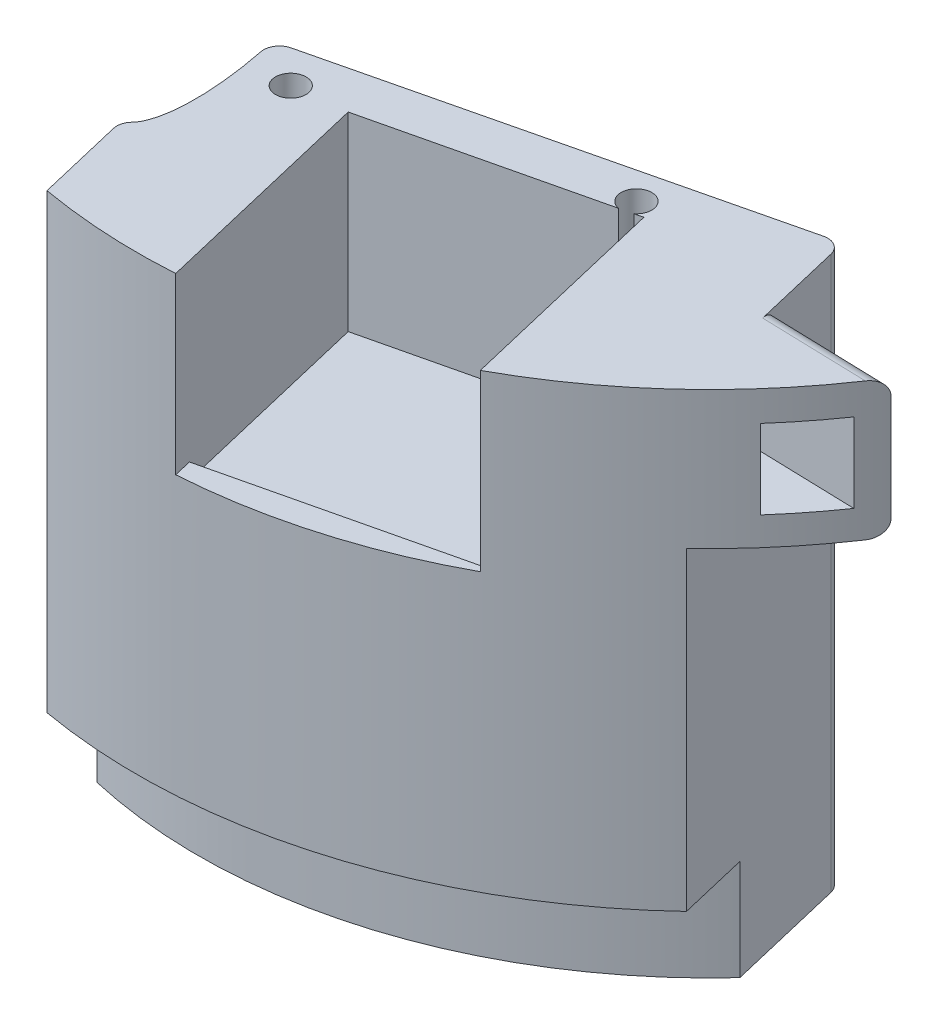
ISO-10303-21;
HEADER;
FILE_DESCRIPTION(('STEP AP214'),'2;1');
FILE_NAME('part.step','',(''),(''),'','','');
FILE_SCHEMA(('AUTOMOTIVE_DESIGN { 1 0 10303 214 1 1 1 1 }'));
ENDSEC;
DATA;
#1=APPLICATION_CONTEXT('core data for automotive mechanical design processes');
#2=APPLICATION_PROTOCOL_DEFINITION('international standard','automotive_design',2000,#1);
#3=PRODUCT_CONTEXT('',#1,'mechanical');
#4=PRODUCT('Part','Part','',(#3));
#5=PRODUCT_RELATED_PRODUCT_CATEGORY('part','',(#4));
#6=PRODUCT_DEFINITION_FORMATION('','',#4);
#7=PRODUCT_DEFINITION_CONTEXT('part definition',#1,'design');
#8=PRODUCT_DEFINITION('design','',#6,#7);
#9=PRODUCT_DEFINITION_SHAPE('','',#8);
#10=(LENGTH_UNIT() NAMED_UNIT(*) SI_UNIT(.MILLI.,.METRE.));
#11=(NAMED_UNIT(*) PLANE_ANGLE_UNIT() SI_UNIT($,.RADIAN.));
#12=(NAMED_UNIT(*) SI_UNIT($,.STERADIAN.) SOLID_ANGLE_UNIT());
#13=UNCERTAINTY_MEASURE_WITH_UNIT(LENGTH_MEASURE(1.E-05),#10,'distance_accuracy_value','');
#14=(GEOMETRIC_REPRESENTATION_CONTEXT(3) GLOBAL_UNCERTAINTY_ASSIGNED_CONTEXT((#13)) GLOBAL_UNIT_ASSIGNED_CONTEXT((#10,
#11,#12)) REPRESENTATION_CONTEXT('',''));
#15=CARTESIAN_POINT('',(0.,0.,0.));
#16=DIRECTION('',(0.,0.,1.));
#17=DIRECTION('',(1.,0.,0.));
#18=AXIS2_PLACEMENT_3D('',#15,#16,#17);
#19=CARTESIAN_POINT('',(0.,88.5939681,0.));
#20=DIRECTION('',(0.,-1.,0.));
#21=DIRECTION('',(0.,0.,-1.));
#22=AXIS2_PLACEMENT_3D('',#19,#20,#21);
#23=CYLINDRICAL_SURFACE('',#22,91.821);
#24=CARTESIAN_POINT('',(0.,88.5939681,0.));
#25=DIRECTION('',(0.,1.,0.));
#26=DIRECTION('',(0.,0.,1.));
#27=AXIS2_PLACEMENT_3D('',#24,#25,#26);
#28=CIRCLE('',#27,91.821);
#29=CARTESIAN_POINT('',(-15.8179255896264,88.5939681,90.4482684800602));
#30=VERTEX_POINT('',#29);
#31=CARTESIAN_POINT('',(5.99705757324061,88.5939681,91.6249493394853));
#32=VERTEX_POINT('',#31);
#33=EDGE_CURVE('E407',#30,#32,#28,.T.);
#34=ORIENTED_EDGE('',*,*,#33,.F.);
#35=DIRECTION('',(0.,-1.,0.));
#36=VECTOR('',#35,1.);
#37=CARTESIAN_POINT('',(-15.8179255896264,88.5939681,90.4482684800602));
#38=LINE('',#37,#36);
#39=CARTESIAN_POINT('',(-15.8179255896264,16.129,90.4482684800602));
#40=VERTEX_POINT('',#39);
#41=EDGE_CURVE('E329',#30,#40,#38,.T.);
#42=ORIENTED_EDGE('',*,*,#41,.T.);
#43=CARTESIAN_POINT('',(0.,16.129,0.));
#44=DIRECTION('',(0.,-1.,0.));
#45=DIRECTION('',(0.,0.,-1.));
#46=AXIS2_PLACEMENT_3D('',#43,#44,#45);
#47=CIRCLE('',#46,91.821);
#48=CARTESIAN_POINT('',(63.0178395026787,16.129,66.7820929996555));
#49=VERTEX_POINT('',#48);
#50=EDGE_CURVE('E350',#49,#40,#47,.T.);
#51=ORIENTED_EDGE('',*,*,#50,.F.);
#52=DIRECTION('',(0.,-1.,0.));
#53=VECTOR('',#52,1.);
#54=CARTESIAN_POINT('',(63.0178395026787,88.5939681,66.7820929996555));
#55=LINE('',#54,#53);
#56=CARTESIAN_POINT('',(63.0178395026786,66.5169721234457,66.7820929996554));
#57=VERTEX_POINT('',#56);
#58=EDGE_CURVE('E413',#57,#49,#55,.T.);
#59=ORIENTED_EDGE('',*,*,#58,.F.);
#60=CARTESIAN_POINT('',(0.,66.5169721234458,0.));
#61=DIRECTION('',(0.,1.,0.));
#62=DIRECTION('',(-1.,0.,0.));
#63=AXIS2_PLACEMENT_3D('',#60,#61,#62);
#64=CIRCLE('',#63,91.8209999999999);
#65=CARTESIAN_POINT('',(76.1766200380925,66.5169721234457,51.2661545327136));
#66=VERTEX_POINT('',#65);
#67=EDGE_CURVE('E337',#57,#66,#64,.T.);
#68=ORIENTED_EDGE('',*,*,#67,.T.);
#69=CARTESIAN_POINT('',(76.1766200380925,66.5169721234457,51.2661545327136));
#70=CARTESIAN_POINT('',(76.2970398925171,66.5169594485425,51.0872936112113));
#71=CARTESIAN_POINT('',(76.416978905924,66.5366239446764,50.9076453419317));
#72=CARTESIAN_POINT('',(76.6524375199737,66.6162061107512,50.552385659657));
#73=CARTESIAN_POINT('',(76.7679136879208,66.6764470730275,50.3768184767578));
#74=CARTESIAN_POINT('',(76.9767778068579,66.8292324316901,50.057012434243));
#75=CARTESIAN_POINT('',(77.0711990493383,66.9175063020773,49.9114499483556));
#76=CARTESIAN_POINT('',(77.203703726724,67.0736630284687,49.7060441917631));
#77=CARTESIAN_POINT('',(77.24629337072,67.1295708186149,49.6398221003821));
#78=CARTESIAN_POINT('',(77.3280038253407,67.2491270378233,49.5124386421364));
#79=CARTESIAN_POINT('',(77.3671259904833,67.312772421064,49.4512752997777));
#80=CARTESIAN_POINT('',(77.4579393117707,67.4776275400914,49.3089609212215));
#81=CARTESIAN_POINT('',(77.5074463396581,67.582924115146,49.2310739316725));
#82=CARTESIAN_POINT('',(77.5962734403394,67.8075426292515,49.0909494122973));
#83=CARTESIAN_POINT('',(77.6355902100787,67.9268690977574,49.0287169569));
#84=CARTESIAN_POINT('',(77.6856849716485,68.1144540802149,48.9492734918238));
#85=CARTESIAN_POINT('',(77.7009397955156,68.1786485086836,48.9250513645892));
#86=CARTESIAN_POINT('',(77.7282414334615,68.3093750762813,48.8816651046282));
#87=CARTESIAN_POINT('',(77.740289752844,68.3759061018233,48.8624985985622));
#88=CARTESIAN_POINT('',(77.7609998707602,68.5106691565248,48.8295332637943));
#89=CARTESIAN_POINT('',(77.769667577709,68.5788979942444,48.8157250703964));
#90=CARTESIAN_POINT('',(77.783521863673,68.7165605650736,48.7936465012619));
#91=CARTESIAN_POINT('',(77.7887108763891,68.7859934208901,48.785372253976));
#92=CARTESIAN_POINT('',(77.7937652682831,68.8891874315794,48.7773116751134));
#93=CARTESIAN_POINT('',(77.7949958394203,68.9227290815569,48.7753489652449));
#94=CARTESIAN_POINT('',(77.7966353989379,68.9898361716217,48.7727338073959));
#95=CARTESIAN_POINT('',(77.7970455404106,69.0234015118989,48.7720795204618));
#96=CARTESIAN_POINT('',(77.7970454718036,69.0569721234457,48.7720796855959));
#97=B_SPLINE_CURVE_WITH_KNOTS('',3,(#69,#70,#71,#72,#73,#74,#75,#76,#77,#78,#79,#80,#81,#82,#83,
#84,#85,#86,#87,#88,#89,#90,#91,#92,#93,#94,#95,#96),.UNSPECIFIED.,.F.,.F.,(4,2,2,2,2,2,2,2,2,2,
2,2,2,4),(0.,0.646594192625357,1.29840202678712,1.87867942108626,2.16794699921131,
2.45710107668497,2.87531977583691,3.29367386669958,3.50429102503875,3.71480913337716,
3.9249576451887,4.13495898286201,4.23579328525186,4.33648576782071),.UNSPECIFIED.);
#98=CARTESIAN_POINT('',(77.7970454718035,69.0569721234457,48.7720796855959));
#99=VERTEX_POINT('',#98);
#100=EDGE_CURVE('E437',#66,#99,#97,.T.);
#101=ORIENTED_EDGE('',*,*,#100,.T.);
#102=DIRECTION('',(0.,1.,0.));
#103=VECTOR('',#102,1.);
#104=CARTESIAN_POINT('',(77.7970454718035,56.0819680999999,48.7720796855959));
#105=LINE('',#104,#103);
#106=CARTESIAN_POINT('',(77.7970454718036,86.0539681,48.772079685596));
#107=VERTEX_POINT('',#106);
#108=EDGE_CURVE('E336',#99,#107,#105,.T.);
#109=ORIENTED_EDGE('',*,*,#108,.T.);
#110=CARTESIAN_POINT('',(77.7970454718036,86.0539681,48.7720796855959));
#111=CARTESIAN_POINT('',(77.7970516451824,86.1182685847056,48.7720688180667));
#112=CARTESIAN_POINT('',(77.7955416177437,86.1825628821888,48.7744784801679));
#113=CARTESIAN_POINT('',(77.7895366328495,86.3106355586566,48.7840556917233));
#114=CARTESIAN_POINT('',(77.7850426424369,86.3744140980124,48.7912216997402));
#115=CARTESIAN_POINT('',(77.7731422812436,86.5007272121393,48.810188470969));
#116=CARTESIAN_POINT('',(77.7657482667767,86.563265897306,48.8219695701189));
#117=CARTESIAN_POINT('',(77.7481426232847,86.6869131464792,48.8500013541869));
#118=CARTESIAN_POINT('',(77.7379308778038,86.7480216512634,48.8662522238393));
#119=CARTESIAN_POINT('',(77.7032485848962,86.9284651792203,48.9213972041721));
#120=CARTESIAN_POINT('',(77.6747094308772,87.0451424649073,48.9667181499235));
#121=CARTESIAN_POINT('',(77.6079662844349,87.2684406439524,49.072431108101));
#122=CARTESIAN_POINT('',(77.5697542032535,87.3750530178146,49.1328357333246));
#123=CARTESIAN_POINT('',(77.4828699785021,87.581383727829,49.2697450879662));
#124=CARTESIAN_POINT('',(77.4337669183064,87.6804816686707,49.3469090284947));
#125=CARTESIAN_POINT('',(77.3279831315803,87.8640357481314,49.5125107831996));
#126=CARTESIAN_POINT('',(77.2713012861871,87.9484897206119,49.600950261904));
#127=CARTESIAN_POINT('',(77.144066371418,88.1120433876292,49.7986402256103));
#128=CARTESIAN_POINT('',(77.0726679728682,88.189019540922,49.9091014972111));
#129=CARTESIAN_POINT('',(76.9239599051627,88.3230493283344,50.1380012417723));
#130=CARTESIAN_POINT('',(76.8466419814762,88.3800745014051,50.2564508256577));
#131=CARTESIAN_POINT('',(76.6728265775039,88.4830119741901,50.5213125546437));
#132=CARTESIAN_POINT('',(76.5754693373241,88.5247762260448,50.6687729607864));
#133=CARTESIAN_POINT('',(76.37772600992,88.5802281984844,50.9663793843891));
#134=CARTESIAN_POINT('',(76.2773483434068,88.5939877488997,51.1165175321703));
#135=CARTESIAN_POINT('',(76.1766200380926,88.5939681,51.2661545327136));
#136=B_SPLINE_CURVE_WITH_KNOTS('',3,(#110,#111,#112,#113,#114,#115,#116,#117,#118,#119,#120,
#121,#122,#123,#124,#125,#126,#127,#128,#129,#130,#131,#132,#133,#134,#135),.UNSPECIFIED.,.F.,
.F.,(4,2,2,2,2,2,2,2,2,2,2,2,4),(0.,0.192828230381417,0.385593999459885,0.577547209257129,
0.76950835361077,1.15275566531155,1.53632452342322,1.93927138705676,2.34227780391077,
2.79767819744972,3.25372561807894,3.79611554601688,4.33711252478252),.UNSPECIFIED.);
#137=CARTESIAN_POINT('',(76.1766200380926,88.5939681,51.2661545327136));
#138=VERTEX_POINT('',#137);
#139=EDGE_CURVE('E429',#107,#138,#136,.T.);
#140=ORIENTED_EDGE('',*,*,#139,.T.);
#141=CARTESIAN_POINT('',(43.8606609264869,88.5939681,80.6680758670476));
#142=VERTEX_POINT('',#141);
#143=EDGE_CURVE('E410',#142,#138,#28,.T.);
#144=ORIENTED_EDGE('',*,*,#143,.F.);
#145=DIRECTION('',(0.,-1.,0.));
#146=VECTOR('',#145,1.);
#147=CARTESIAN_POINT('',(43.8606609264869,88.5939681,80.6680758670476));
#148=LINE('',#147,#146);
#149=CARTESIAN_POINT('',(43.8606609264869,60.6539681,80.6680758670476));
#150=VERTEX_POINT('',#149);
#151=EDGE_CURVE('E362',#142,#150,#148,.T.);
#152=ORIENTED_EDGE('',*,*,#151,.T.);
#153=CARTESIAN_POINT('',(0.,60.6539681,0.));
#154=DIRECTION('',(0.,-1.,0.));
#155=DIRECTION('',(1.,0.,0.));
#156=AXIS2_PLACEMENT_3D('',#153,#154,#155);
#157=CIRCLE('',#156,91.821);
#158=CARTESIAN_POINT('',(5.9970575732406,60.6539681,91.6249493394853));
#159=VERTEX_POINT('',#158);
#160=EDGE_CURVE('E366',#150,#159,#157,.T.);
#161=ORIENTED_EDGE('',*,*,#160,.T.);
#162=DIRECTION('',(0.,-1.,0.));
#163=VECTOR('',#162,1.);
#164=CARTESIAN_POINT('',(5.99705757324061,88.5939681,91.6249493394853));
#165=LINE('',#164,#163);
#166=EDGE_CURVE('E369',#159,#32,#165,.F.);
#167=ORIENTED_EDGE('',*,*,#166,.T.);
#168=EDGE_LOOP('',(#34,#42,#51,#59,#68,#101,#109,#140,#144,#152,#161,#167));
#169=FACE_BOUND('',#168,.T.);
#170=CARTESIAN_POINT('',(0.,83.7679681,0.));
#171=DIRECTION('',(0.,-1.,0.));
#172=DIRECTION('',(0.,0.,-1.));
#173=AXIS2_PLACEMENT_3D('',#170,#171,#172);
#174=CIRCLE('',#173,91.821);
#175=CARTESIAN_POINT('',(75.4248260692558,83.7679681,52.3659398218204));
#176=VERTEX_POINT('',#175);
#177=CARTESIAN_POINT('',(68.837762429988,83.7679681,60.7656029726731));
#178=VERTEX_POINT('',#177);
#179=EDGE_CURVE('E230',#176,#178,#174,.T.);
#180=ORIENTED_EDGE('',*,*,#179,.F.);
#181=DIRECTION('',(0.,-1.,0.));
#182=VECTOR('',#181,1.);
#183=CARTESIAN_POINT('',(75.4248260692558,88.5939681,52.3659398218204));
#184=LINE('',#183,#182);
#185=CARTESIAN_POINT('',(75.4248260692558,71.0679681,52.3659398218204));
#186=VERTEX_POINT('',#185);
#187=EDGE_CURVE('E304',#186,#176,#184,.F.);
#188=ORIENTED_EDGE('',*,*,#187,.F.);
#189=CARTESIAN_POINT('',(0.,71.0679681,0.));
#190=DIRECTION('',(0.,-1.,0.));
#191=DIRECTION('',(0.,0.,-1.));
#192=AXIS2_PLACEMENT_3D('',#189,#190,#191);
#193=CIRCLE('',#192,91.821);
#194=CARTESIAN_POINT('',(68.837762429988,71.0679681,60.7656029726731));
#195=VERTEX_POINT('',#194);
#196=EDGE_CURVE('E221',#186,#195,#193,.T.);
#197=ORIENTED_EDGE('',*,*,#196,.T.);
#198=DIRECTION('',(0.,-1.,0.));
#199=VECTOR('',#198,1.);
#200=CARTESIAN_POINT('',(68.837762429988,88.5939681,60.7656029726731));
#201=LINE('',#200,#199);
#202=EDGE_CURVE('E306',#178,#195,#201,.T.);
#203=ORIENTED_EDGE('',*,*,#202,.F.);
#204=EDGE_LOOP('',(#180,#188,#197,#203));
#205=FACE_BOUND('',#204,.T.);
#206=ADVANCED_FACE('F37',(#169,#205),#23,.T.);
#207=CARTESIAN_POINT('',(43.6240724776344,58.1139681,79.6702599019146));
#208=DIRECTION('',(0.973022607104429,0.,-0.230709787533387));
#209=DIRECTION('',(-0.230709787533387,0.,-0.973022607104429));
#210=AXIS2_PLACEMENT_3D('',#207,#208,#209);
#211=PLANE('',#210);
#212=DIRECTION('',(-0.230709787533387,0.,-0.973022607104429));
#213=VECTOR('',#212,1.);
#214=CARTESIAN_POINT('',(43.6240724776344,88.5939681,79.6702599019146));
#215=LINE('',#214,#213);
#216=CARTESIAN_POINT('',(35.7130338631146,88.5939681,46.3053147043038));
#217=VERTEX_POINT('',#216);
#218=EDGE_CURVE('E390',#142,#217,#215,.T.);
#219=ORIENTED_EDGE('',*,*,#218,.T.);
#220=DIRECTION('',(0.,1.,0.));
#221=VECTOR('',#220,1.);
#222=CARTESIAN_POINT('',(35.7130338631146,58.1139681,46.3053147043038));
#223=LINE('',#222,#221);
#224=CARTESIAN_POINT('',(35.7130338631146,58.1139681,46.3053147043038));
#225=VERTEX_POINT('',#224);
#226=EDGE_CURVE('E400',#225,#217,#223,.T.);
#227=ORIENTED_EDGE('',*,*,#226,.F.);
#228=DIRECTION('',(-0.230709787533387,0.,-0.973022607104429));
#229=VECTOR('',#228,1.);
#230=CARTESIAN_POINT('',(43.6240724776344,58.1139681,79.6702599019146));
#231=LINE('',#230,#229);
#232=CARTESIAN_POINT('',(43.6240724776344,58.1139681,79.6702599019146));
#233=VERTEX_POINT('',#232);
#234=EDGE_CURVE('E380',#233,#225,#231,.T.);
#235=ORIENTED_EDGE('',*,*,#234,.F.);
#236=DIRECTION('',(0.,1.,0.));
#237=VECTOR('',#236,1.);
#238=CARTESIAN_POINT('',(43.6240724776344,58.1139681,79.6702599019146));
#239=LINE('',#238,#237);
#240=CARTESIAN_POINT('',(43.6240724776344,60.6539681,79.6702599019147));
#241=VERTEX_POINT('',#240);
#242=EDGE_CURVE('E402',#233,#241,#239,.T.);
#243=ORIENTED_EDGE('',*,*,#242,.T.);
#244=DIRECTION('',(-0.230709787533387,0.,-0.973022607104429));
#245=VECTOR('',#244,1.);
#246=CARTESIAN_POINT('',(47.3840137174595,60.6539681,95.5278785441434));
#247=LINE('',#246,#245);
#248=EDGE_CURVE('E359',#150,#241,#247,.T.);
#249=ORIENTED_EDGE('',*,*,#248,.F.);
#250=ORIENTED_EDGE('',*,*,#151,.F.);
#251=EDGE_LOOP('',(#219,#227,#235,#243,#249,#250));
#252=FACE_BOUND('',#251,.T.);
#253=DIRECTION('',(-0.230709787533387,0.,-0.973022607104429));
#254=VECTOR('',#253,1.);
#255=CARTESIAN_POINT('',(43.6240724776344,83.7679681,79.6702599019146));
#256=LINE('',#255,#254);
#257=CARTESIAN_POINT('',(38.936049594956,83.7679681,59.8984405255527));
#258=VERTEX_POINT('',#257);
#259=CARTESIAN_POINT('',(36.8850395837842,83.7679681,51.2482695483943));
#260=VERTEX_POINT('',#259);
#261=EDGE_CURVE('E227',#258,#260,#256,.T.);
#262=ORIENTED_EDGE('',*,*,#261,.F.);
#263=DIRECTION('',(0.,-1.,0.));
#264=VECTOR('',#263,1.);
#265=CARTESIAN_POINT('',(38.936049594956,83.7679681,59.8984405255527));
#266=LINE('',#265,#264);
#267=CARTESIAN_POINT('',(38.936049594956,71.0679681,59.8984405255527));
#268=VERTEX_POINT('',#267);
#269=EDGE_CURVE('E211',#258,#268,#266,.T.);
#270=ORIENTED_EDGE('',*,*,#269,.T.);
#271=DIRECTION('',(-0.230709787533387,0.,-0.973022607104429));
#272=VECTOR('',#271,1.);
#273=CARTESIAN_POINT('',(43.6240724776344,71.0679681,79.6702599019146));
#274=LINE('',#273,#272);
#275=CARTESIAN_POINT('',(36.8850395837842,71.0679681,51.2482695483943));
#276=VERTEX_POINT('',#275);
#277=EDGE_CURVE('E237',#268,#276,#274,.T.);
#278=ORIENTED_EDGE('',*,*,#277,.T.);
#279=DIRECTION('',(0.,-1.,0.));
#280=VECTOR('',#279,1.);
#281=CARTESIAN_POINT('',(36.8850395837842,83.7679681,51.2482695483943));
#282=LINE('',#281,#280);
#283=EDGE_CURVE('E222',#260,#276,#282,.T.);
#284=ORIENTED_EDGE('',*,*,#283,.F.);
#285=EDGE_LOOP('',(#262,#270,#278,#284));
#286=FACE_BOUND('',#285,.T.);
#287=ADVANCED_FACE('F235',(#252,#286),#211,.F.);
#288=CARTESIAN_POINT('',(35.7130338631146,58.1139681,46.3053147043038));
#289=DIRECTION('',(-0.230709787533387,0.,-0.973022607104429));
#290=DIRECTION('',(-0.973022607104429,0.,0.230709787533387));
#291=AXIS2_PLACEMENT_3D('',#288,#289,#290);
#292=PLANE('',#291);
#293=DIRECTION('',(-0.973022607104429,0.,0.230709787533387));
#294=VECTOR('',#293,1.);
#295=CARTESIAN_POINT('',(35.7130338631146,88.5939681,46.3053147043038));
#296=LINE('',#295,#294);
#297=CARTESIAN_POINT('',(34.4176603081381,88.5939681,46.6124559315095));
#298=VERTEX_POINT('',#297);
#299=EDGE_CURVE('E377',#217,#298,#296,.T.);
#300=ORIENTED_EDGE('',*,*,#299,.T.);
#301=DIRECTION('',(0.,-1.,0.));
#302=VECTOR('',#301,1.);
#303=CARTESIAN_POINT('',(34.4176603081381,0.,46.6124559315095));
#304=LINE('',#303,#302);
#305=CARTESIAN_POINT('',(34.4176603081381,58.1139681,46.6124559315095));
#306=VERTEX_POINT('',#305);
#307=EDGE_CURVE('E278',#298,#306,#304,.T.);
#308=ORIENTED_EDGE('',*,*,#307,.T.);
#309=DIRECTION('',(-0.973022607104429,0.,0.230709787533387));
#310=VECTOR('',#309,1.);
#311=CARTESIAN_POINT('',(35.7130338631146,58.1139681,46.3053147043038));
#312=LINE('',#311,#310);
#313=EDGE_CURVE('E384',#225,#306,#312,.T.);
#314=ORIENTED_EDGE('',*,*,#313,.F.);
#315=ORIENTED_EDGE('',*,*,#226,.T.);
#316=EDGE_LOOP('',(#300,#308,#314,#315));
#317=FACE_BOUND('',#316,.T.);
#318=ADVANCED_FACE('F533',(#317),#292,.F.);
#319=CARTESIAN_POINT('',(0.,88.5939681,0.));
#320=DIRECTION('',(0.,1.,0.));
#321=DIRECTION('',(0.,0.,1.));
#322=AXIS2_PLACEMENT_3D('',#319,#320,#321);
#323=PLANE('',#322);
#324=DIRECTION('',(0.972349872189213,0.,-0.233528854862994));
#325=VECTOR('',#324,1.);
#326=CARTESIAN_POINT('',(10.717954049578,88.5939681,44.6266105160803));
#327=LINE('',#326,#325);
#328=CARTESIAN_POINT('',(-16.0687872038001,88.5939681,51.0599707594757));
#329=VERTEX_POINT('',#328);
#330=CARTESIAN_POINT('',(52.7529349235929,88.5939681,34.5310870543501));
#331=VERTEX_POINT('',#330);
#332=EDGE_CURVE('E288',#329,#331,#327,.T.);
#333=ORIENTED_EDGE('',*,*,#332,.F.);
#334=CARTESIAN_POINT('',(-15.4756239124481,88.5939681,53.5297394348363));
#335=DIRECTION('',(0.,1.,0.));
#336=DIRECTION('',(0.,0.,1.));
#337=AXIS2_PLACEMENT_3D('',#334,#335,#336);
#338=CIRCLE('',#337,2.54);
#339=CARTESIAN_POINT('',(-17.9643185695792,88.5939681,54.0376753595031));
#340=VERTEX_POINT('',#339);
#341=EDGE_CURVE('E257',#329,#340,#338,.T.);
#342=ORIENTED_EDGE('',*,*,#341,.T.);
#343=CARTESIAN_POINT('',(-24.6674802637737,88.5939681,53.1251152111256));
#344=DIRECTION('',(0.,-1.,0.));
#345=DIRECTION('',(0.230709787533387,0.,0.973022607104429));
#346=AXIS2_PLACEMENT_3D('',#343,#344,#345);
#347=ELLIPSE('',#346,22.225,6.35);
#348=CARTESIAN_POINT('',(-18.4996175694869,88.5939681,74.1212150728599));
#349=VERTEX_POINT('',#348);
#350=EDGE_CURVE('E286',#349,#340,#347,.F.);
#351=ORIENTED_EDGE('',*,*,#350,.F.);
#352=CARTESIAN_POINT('',(-16.6627886491647,88.5939681,75.8755410167677));
#353=DIRECTION('',(0.,1.,0.));
#354=DIRECTION('',(0.,0.,1.));
#355=AXIS2_PLACEMENT_3D('',#352,#353,#354);
#356=CIRCLE('',#355,2.54);
#357=CARTESIAN_POINT('',(-19.1342660712099,88.5939681,76.4615438771026));
#358=VERTEX_POINT('',#357);
#359=EDGE_CURVE('E255',#349,#358,#356,.T.);
#360=ORIENTED_EDGE('',*,*,#359,.T.);
#361=DIRECTION('',(-0.230709787533387,0.,-0.973022607104429));
#362=VECTOR('',#361,1.);
#363=CARTESIAN_POINT('',(-35.2803401996955,88.5939681,8.36519083127922));
#364=LINE('',#363,#362);
#365=EDGE_CURVE('E332',#30,#358,#364,.T.);
#366=ORIENTED_EDGE('',*,*,#365,.F.);
#367=ORIENTED_EDGE('',*,*,#33,.T.);
#368=DIRECTION('',(0.230709787533387,0.,0.973022607104429));
#369=VECTOR('',#368,1.);
#370=CARTESIAN_POINT('',(-2.5948661785868,88.5939681,55.3883590394932));
#371=LINE('',#370,#369);
#372=CARTESIAN_POINT('',(-2.5948661785868,88.5939681,55.3883590394932));
#373=VERTEX_POINT('',#372);
#374=EDGE_CURVE('E372',#373,#32,#371,.T.);
#375=ORIENTED_EDGE('',*,*,#374,.F.);
#376=CARTESIAN_POINT('',(32.4088027918283,88.5939681,47.0887686989507));
#377=VERTEX_POINT('',#376);
#378=EDGE_CURVE('E393',#377,#373,#296,.T.);
#379=ORIENTED_EDGE('',*,*,#378,.F.);
#380=CARTESIAN_POINT('',(32.898719502623,88.5939681,44.6806486606253));
#381=DIRECTION('',(0.,1.,0.));
#382=DIRECTION('',(0.,0.,1.));
#383=AXIS2_PLACEMENT_3D('',#380,#381,#382);
#384=CIRCLE('',#383,2.45744999999998);
#385=EDGE_CURVE('E317',#298,#377,#384,.T.);
#386=ORIENTED_EDGE('',*,*,#385,.F.);
#387=ORIENTED_EDGE('',*,*,#299,.F.);
#388=ORIENTED_EDGE('',*,*,#218,.F.);
#389=ORIENTED_EDGE('',*,*,#143,.T.);
#390=DIRECTION('',(-0.999579752670486,0.,-0.0289882398777588));
#391=VECTOR('',#390,1.);
#392=CARTESIAN_POINT('',(58.5420270489124,88.5939681,50.7547438020027));
#393=LINE('',#392,#391);
#394=CARTESIAN_POINT('',(59.2223319811587,88.5939681,50.7744729356845));
#395=VERTEX_POINT('',#394);
#396=EDGE_CURVE('E471',#138,#395,#393,.T.);
#397=ORIENTED_EDGE('',*,*,#396,.T.);
#398=DIRECTION('',(-0.230709787533385,0.,-0.973022607104429));
#399=VECTOR('',#398,1.);
#400=CARTESIAN_POINT('',(63.0178395026787,88.5939681,66.7820929996555));
#401=LINE('',#400,#399);
#402=CARTESIAN_POINT('',(55.8175756369902,88.5939681,36.4148528693759));
#403=VERTEX_POINT('',#402);
#404=EDGE_CURVE('E409',#395,#403,#401,.T.);
#405=ORIENTED_EDGE('',*,*,#404,.T.);
#406=CARTESIAN_POINT('',(53.3460982149449,88.5939681,37.0008557297107));
#407=DIRECTION('',(0.,1.,0.));
#408=DIRECTION('',(0.,0.,1.));
#409=AXIS2_PLACEMENT_3D('',#406,#407,#408);
#410=CIRCLE('',#409,2.54);
#411=EDGE_CURVE('E240',#403,#331,#410,.T.);
#412=ORIENTED_EDGE('',*,*,#411,.T.);
#413=EDGE_LOOP('',(#333,#342,#351,#360,#366,#367,#375,#379,#386,#387,#388,#389,#397,#405,#412));
#414=FACE_BOUND('',#413,.T.);
#415=CARTESIAN_POINT('',(-10.8535717197009,88.5939681,56.3380058031579));
#416=DIRECTION('',(0.,1.,0.));
#417=DIRECTION('',(0.,0.,1.));
#418=AXIS2_PLACEMENT_3D('',#415,#416,#417);
#419=CIRCLE('',#418,2.45744999999998);
#420=CARTESIAN_POINT('',(-10.8535717197009,88.5939681,58.7954558031579));
#421=VERTEX_POINT('',#420);
#422=EDGE_CURVE('E311',#421,#421,#419,.T.);
#423=ORIENTED_EDGE('',*,*,#422,.F.);
#424=EDGE_LOOP('',(#423));
#425=FACE_BOUND('',#424,.T.);
#426=ADVANCED_FACE('F284',(#414,#425),#323,.T.);
#427=CARTESIAN_POINT('',(87.9752522273986,66.5169721234457,49.067252029942));
#428=DIRECTION('',(0.,1.,0.));
#429=DIRECTION('',(-1.,0.,0.));
#430=AXIS2_PLACEMENT_3D('',#427,#428,#429);
#431=PLANE('',#430);
#432=DIRECTION('',(-0.230709787533385,0.,-0.973022607104429));
#433=VECTOR('',#432,1.);
#434=CARTESIAN_POINT('',(63.0178395026787,66.5169721234457,66.7820929996555));
#435=LINE('',#434,#433);
#436=CARTESIAN_POINT('',(59.2223319811587,66.5169721234457,50.7744729356845));
#437=VERTEX_POINT('',#436);
#438=EDGE_CURVE('E419',#57,#437,#435,.T.);
#439=ORIENTED_EDGE('',*,*,#438,.T.);
#440=DIRECTION('',(-0.999579752670486,0.,-0.0289882398777588));
#441=VECTOR('',#440,1.);
#442=CARTESIAN_POINT('',(87.9016220981091,66.5169721234457,51.606184601725));
#443=LINE('',#442,#441);
#444=EDGE_CURVE('E427',#437,#66,#443,.F.);
#445=ORIENTED_EDGE('',*,*,#444,.T.);
#446=ORIENTED_EDGE('',*,*,#67,.F.);
#447=EDGE_LOOP('',(#439,#445,#446));
#448=FACE_BOUND('',#447,.T.);
#449=ADVANCED_FACE('F549',(#448),#431,.F.);
#450=CARTESIAN_POINT('',(87.9752522273986,66.5169721234457,49.067252029942));
#451=DIRECTION('',(-0.0289882398777588,0.,0.999579752670486));
#452=DIRECTION('',(0.999579752670486,0.,0.0289882398777588));
#453=AXIS2_PLACEMENT_3D('',#450,#451,#452);
#454=PLANE('',#453);
#455=ORIENTED_EDGE('',*,*,#108,.F.);
#456=DIRECTION('',(-0.999579752670486,0.,-0.0289882398777588));
#457=VECTOR('',#456,1.);
#458=CARTESIAN_POINT('',(87.9752522273986,69.0569721234457,49.067252029942));
#459=LINE('',#458,#457);
#460=CARTESIAN_POINT('',(58.6156571782019,69.0569721234457,48.2158112302197));
#461=VERTEX_POINT('',#460);
#462=EDGE_CURVE('E424',#99,#461,#459,.T.);
#463=ORIENTED_EDGE('',*,*,#462,.T.);
#464=DIRECTION('',(0.,1.,0.));
#465=VECTOR('',#464,1.);
#466=CARTESIAN_POINT('',(58.6156571782019,88.5939681,48.2158112302197));
#467=LINE('',#466,#465);
#468=CARTESIAN_POINT('',(58.6156571782019,86.0539681,48.2158112302197));
#469=VERTEX_POINT('',#468);
#470=EDGE_CURVE('E340',#461,#469,#467,.T.);
#471=ORIENTED_EDGE('',*,*,#470,.T.);
#472=DIRECTION('',(-0.999579752670486,0.,-0.0289882398777588));
#473=VECTOR('',#472,1.);
#474=CARTESIAN_POINT('',(77.7970454718036,86.0539681,48.7720796855959));
#475=LINE('',#474,#473);
#476=EDGE_CURVE('E422',#469,#107,#475,.F.);
#477=ORIENTED_EDGE('',*,*,#476,.T.);
#478=EDGE_LOOP('',(#455,#463,#471,#477));
#479=FACE_BOUND('',#478,.T.);
#480=ADVANCED_FACE('F505',(#479),#454,.F.);
#481=CARTESIAN_POINT('',(63.0178395026787,88.5939681,66.7820929996555));
#482=DIRECTION('',(-0.973022607104429,0.,0.230709787533385));
#483=DIRECTION('',(0.230709787533385,0.,0.973022607104429));
#484=AXIS2_PLACEMENT_3D('',#481,#482,#483);
#485=PLANE('',#484);
#486=DIRECTION('',(-0.230709787533385,0.,-0.973022607104429));
#487=VECTOR('',#486,1.);
#488=CARTESIAN_POINT('',(63.0178395026787,0.,66.7820929996555));
#489=LINE('',#488,#487);
#490=CARTESIAN_POINT('',(60.359488813229,0.,55.5704519760952));
#491=VERTEX_POINT('',#490);
#492=CARTESIAN_POINT('',(55.8175756369902,0.,36.4148528693759));
#493=VERTEX_POINT('',#492);
#494=EDGE_CURVE('E399',#491,#493,#489,.T.);
#495=ORIENTED_EDGE('',*,*,#494,.T.);
#496=DIRECTION('',(0.,1.,0.));
#497=VECTOR('',#496,1.);
#498=CARTESIAN_POINT('',(55.8175756369902,88.5939681,36.4148528693759));
#499=LINE('',#498,#497);
#500=EDGE_CURVE('E236',#493,#403,#499,.T.);
#501=ORIENTED_EDGE('',*,*,#500,.T.);
#502=ORIENTED_EDGE('',*,*,#404,.F.);
#503=CARTESIAN_POINT('',(59.2223319811587,86.0539681,50.7744729356845));
#504=DIRECTION('',(-0.973022607104429,0.,0.230709787533385));
#505=DIRECTION('',(0.230709787533385,0.,0.973022607104429));
#506=AXIS2_PLACEMENT_3D('',#503,#504,#505);
#507=ELLIPSE('',#506,2.6296014982416,2.54);
#508=EDGE_CURVE('E476',#395,#469,#507,.T.);
#509=ORIENTED_EDGE('',*,*,#508,.T.);
#510=ORIENTED_EDGE('',*,*,#470,.F.);
#511=CARTESIAN_POINT('',(59.2223319811587,69.0569721234457,50.7744729356845));
#512=DIRECTION('',(-0.973022607104429,0.,0.230709787533385));
#513=DIRECTION('',(-0.230709787533385,0.,-0.973022607104429));
#514=AXIS2_PLACEMENT_3D('',#511,#512,#513);
#515=ELLIPSE('',#514,2.6296014982416,2.54);
#516=EDGE_CURVE('E473',#461,#437,#515,.T.);
#517=ORIENTED_EDGE('',*,*,#516,.T.);
#518=ORIENTED_EDGE('',*,*,#438,.F.);
#519=ORIENTED_EDGE('',*,*,#58,.T.);
#520=DIRECTION('',(0.230709787533385,0.,0.973022607104429));
#521=VECTOR('',#520,1.);
#522=CARTESIAN_POINT('',(63.0178395026787,16.129,66.7820929996555));
#523=LINE('',#522,#521);
#524=CARTESIAN_POINT('',(60.3594888132291,16.129,55.5704519760953));
#525=VERTEX_POINT('',#524);
#526=EDGE_CURVE('E353',#525,#49,#523,.T.);
#527=ORIENTED_EDGE('',*,*,#526,.F.);
#528=DIRECTION('',(0.,1.,0.));
#529=VECTOR('',#528,1.);
#530=CARTESIAN_POINT('',(60.359488813229,88.5939681,55.5704519760952));
#531=LINE('',#530,#529);
#532=EDGE_CURVE('E347',#491,#525,#531,.T.);
#533=ORIENTED_EDGE('',*,*,#532,.F.);
#534=EDGE_LOOP('',(#495,#501,#502,#509,#510,#517,#518,#519,#527,#533));
#535=FACE_BOUND('',#534,.T.);
#536=ADVANCED_FACE('F451',(#535),#485,.F.);
#537=CARTESIAN_POINT('',(0.,0.,0.));
#538=DIRECTION('',(0.,1.,0.));
#539=DIRECTION('',(0.,0.,1.));
#540=AXIS2_PLACEMENT_3D('',#537,#538,#539);
#541=PLANE('',#540);
#542=CARTESIAN_POINT('',(12.1113779621143,0.,63.1703475908273));
#543=DIRECTION('',(0.,-1.,0.));
#544=DIRECTION('',(0.,0.,-1.));
#545=AXIS2_PLACEMENT_3D('',#542,#543,#544);
#546=CIRCLE('',#545,9.52500000000001);
#547=CARTESIAN_POINT('',(12.1113779621143,0.,53.6453475908273));
#548=VERTEX_POINT('',#547);
#549=EDGE_CURVE('E558',#548,#548,#546,.T.);
#550=ORIENTED_EDGE('',*,*,#549,.F.);
#551=EDGE_LOOP('',(#550));
#552=FACE_BOUND('',#551,.T.);
#553=CARTESIAN_POINT('',(-10.8535717197009,0.,56.3380058031579));
#554=DIRECTION('',(0.,-1.,0.));
#555=DIRECTION('',(0.,0.,-1.));
#556=AXIS2_PLACEMENT_3D('',#553,#554,#555);
#557=CIRCLE('',#556,2.45744999999999);
#558=CARTESIAN_POINT('',(-10.8535717197009,0.,53.8805558031579));
#559=VERTEX_POINT('',#558);
#560=EDGE_CURVE('E308',#559,#559,#557,.T.);
#561=ORIENTED_EDGE('',*,*,#560,.F.);
#562=EDGE_LOOP('',(#561));
#563=FACE_BOUND('',#562,.T.);
#564=CARTESIAN_POINT('',(32.898719502623,0.,44.6806486606253));
#565=DIRECTION('',(0.,-1.,0.));
#566=DIRECTION('',(0.,0.,-1.));
#567=AXIS2_PLACEMENT_3D('',#564,#565,#566);
#568=CIRCLE('',#567,2.45744999999999);
#569=CARTESIAN_POINT('',(32.898719502623,0.,42.2231986606253));
#570=VERTEX_POINT('',#569);
#571=EDGE_CURVE('E314',#570,#570,#568,.T.);
#572=ORIENTED_EDGE('',*,*,#571,.F.);
#573=EDGE_LOOP('',(#572));
#574=FACE_BOUND('',#573,.T.);
#575=CARTESIAN_POINT('',(-24.6674802637737,0.,53.1251152111256));
#576=DIRECTION('',(0.,-1.,0.));
#577=DIRECTION('',(0.230709787533387,0.,0.973022607104429));
#578=AXIS2_PLACEMENT_3D('',#575,#576,#577);
#579=ELLIPSE('',#578,22.225,6.35);
#580=CARTESIAN_POINT('',(-17.9643185695792,0.,54.0376753595031));
#581=VERTEX_POINT('',#580);
#582=CARTESIAN_POINT('',(-18.4996175694869,0.,74.1212150728599));
#583=VERTEX_POINT('',#582);
#584=EDGE_CURVE('E269',#581,#583,#579,.T.);
#585=ORIENTED_EDGE('',*,*,#584,.F.);
#586=CARTESIAN_POINT('',(-15.4756239124481,0.,53.5297394348363));
#587=DIRECTION('',(0.,1.,0.));
#588=DIRECTION('',(0.,0.,1.));
#589=AXIS2_PLACEMENT_3D('',#586,#587,#588);
#590=CIRCLE('',#589,2.54);
#591=CARTESIAN_POINT('',(-16.0687872038001,0.,51.0599707594757));
#592=VERTEX_POINT('',#591);
#593=EDGE_CURVE('E45',#581,#592,#590,.F.);
#594=ORIENTED_EDGE('',*,*,#593,.T.);
#595=DIRECTION('',(-0.972349872189213,0.,0.233528854862994));
#596=VECTOR('',#595,1.);
#597=CARTESIAN_POINT('',(68.442798797321,0.,30.762859127155));
#598=LINE('',#597,#596);
#599=CARTESIAN_POINT('',(52.7529349235929,0.,34.5310870543501));
#600=VERTEX_POINT('',#599);
#601=EDGE_CURVE('E267',#600,#592,#598,.T.);
#602=ORIENTED_EDGE('',*,*,#601,.F.);
#603=CARTESIAN_POINT('',(53.3460982149449,0.,37.0008557297107));
#604=DIRECTION('',(0.,1.,0.));
#605=DIRECTION('',(0.,0.,1.));
#606=AXIS2_PLACEMENT_3D('',#603,#604,#605);
#607=CIRCLE('',#606,2.54);
#608=EDGE_CURVE('E250',#600,#493,#607,.F.);
#609=ORIENTED_EDGE('',*,*,#608,.T.);
#610=ORIENTED_EDGE('',*,*,#494,.F.);
#611=CARTESIAN_POINT('',(0.,0.,0.));
#612=DIRECTION('',(0.,1.,0.));
#613=DIRECTION('',(0.,0.,1.));
#614=AXIS2_PLACEMENT_3D('',#611,#612,#613);
#615=CIRCLE('',#614,82.0447623107157);
#616=CARTESIAN_POINT('',(-18.3005634568104,0.,79.9776993904244));
#617=VERTEX_POINT('',#616);
#618=EDGE_CURVE('E417',#617,#491,#615,.T.);
#619=ORIENTED_EDGE('',*,*,#618,.F.);
#620=DIRECTION('',(0.230709787533387,0.,0.973022607104429));
#621=VECTOR('',#620,1.);
#622=CARTESIAN_POINT('',(-24.6674802637737,0.,53.1251152111256));
#623=LINE('',#622,#621);
#624=CARTESIAN_POINT('',(-19.1342660712099,0.,76.4615438771025));
#625=VERTEX_POINT('',#624);
#626=EDGE_CURVE('E277',#625,#617,#623,.T.);
#627=ORIENTED_EDGE('',*,*,#626,.F.);
#628=CARTESIAN_POINT('',(-16.6627886491647,0.,75.8755410167677));
#629=DIRECTION('',(0.,1.,0.));
#630=DIRECTION('',(0.,0.,1.));
#631=AXIS2_PLACEMENT_3D('',#628,#629,#630);
#632=CIRCLE('',#631,2.54);
#633=EDGE_CURVE('E52',#625,#583,#632,.F.);
#634=ORIENTED_EDGE('',*,*,#633,.T.);
#635=EDGE_LOOP('',(#585,#594,#602,#609,#610,#619,#627,#634));
#636=FACE_BOUND('',#635,.T.);
#637=ADVANCED_FACE('F266',(#552,#563,#574,#636),#541,.F.);
#638=CARTESIAN_POINT('',(-2.5948661785868,58.1139681,55.3883590394932));
#639=DIRECTION('',(-0.973022607104429,0.,0.230709787533387));
#640=DIRECTION('',(0.230709787533387,0.,0.973022607104429));
#641=AXIS2_PLACEMENT_3D('',#638,#639,#640);
#642=PLANE('',#641);
#643=ORIENTED_EDGE('',*,*,#374,.T.);
#644=ORIENTED_EDGE('',*,*,#166,.F.);
#645=DIRECTION('',(-0.230709787533387,0.,-0.973022607104429));
#646=VECTOR('',#645,1.);
#647=CARTESIAN_POINT('',(9.07611367575815,60.6539681,104.610922879333));
#648=LINE('',#647,#646);
#649=CARTESIAN_POINT('',(5.31617243593307,60.6539681,88.7533042371041));
#650=VERTEX_POINT('',#649);
#651=EDGE_CURVE('E360',#159,#650,#648,.T.);
#652=ORIENTED_EDGE('',*,*,#651,.T.);
#653=DIRECTION('',(0.,1.,0.));
#654=VECTOR('',#653,1.);
#655=CARTESIAN_POINT('',(5.31617243593306,58.1139681,88.7533042371041));
#656=LINE('',#655,#654);
#657=CARTESIAN_POINT('',(5.31617243593306,58.1139681,88.7533042371041));
#658=VERTEX_POINT('',#657);
#659=EDGE_CURVE('E387',#658,#650,#656,.T.);
#660=ORIENTED_EDGE('',*,*,#659,.F.);
#661=DIRECTION('',(0.230709787533387,0.,0.973022607104429));
#662=VECTOR('',#661,1.);
#663=CARTESIAN_POINT('',(-2.5948661785868,58.1139681,55.3883590394932));
#664=LINE('',#663,#662);
#665=CARTESIAN_POINT('',(-2.5948661785868,58.1139681,55.3883590394932));
#666=VERTEX_POINT('',#665);
#667=EDGE_CURVE('E373',#666,#658,#664,.T.);
#668=ORIENTED_EDGE('',*,*,#667,.F.);
#669=DIRECTION('',(0.,1.,0.));
#670=VECTOR('',#669,1.);
#671=CARTESIAN_POINT('',(-2.5948661785868,58.1139681,55.3883590394932));
#672=LINE('',#671,#670);
#673=EDGE_CURVE('E396',#666,#373,#672,.T.);
#674=ORIENTED_EDGE('',*,*,#673,.T.);
#675=EDGE_LOOP('',(#643,#644,#652,#660,#668,#674));
#676=FACE_BOUND('',#675,.T.);
#677=ADVANCED_FACE('F517',(#676),#642,.F.);
#678=CARTESIAN_POINT('',(32.4088027918283,58.1139681,47.0887686989507));
#679=VERTEX_POINT('',#678);
#680=EDGE_CURVE('E383',#679,#666,#312,.T.);
#681=ORIENTED_EDGE('',*,*,#680,.F.);
#682=DIRECTION('',(0.,-1.,0.));
#683=VECTOR('',#682,1.);
#684=CARTESIAN_POINT('',(32.4088027918283,0.,47.0887686989507));
#685=LINE('',#684,#683);
#686=EDGE_CURVE('E319',#679,#377,#685,.F.);
#687=ORIENTED_EDGE('',*,*,#686,.T.);
#688=ORIENTED_EDGE('',*,*,#378,.T.);
#689=ORIENTED_EDGE('',*,*,#673,.F.);
#690=EDGE_LOOP('',(#681,#687,#688,#689));
#691=FACE_BOUND('',#690,.T.);
#692=ADVANCED_FACE('F524',(#691),#292,.F.);
#693=CARTESIAN_POINT('',(5.31617243593306,58.1139681,88.7533042371041));
#694=DIRECTION('',(0.230709787533387,0.,0.973022607104429));
#695=DIRECTION('',(0.973022607104429,0.,-0.230709787533387));
#696=AXIS2_PLACEMENT_3D('',#693,#694,#695);
#697=PLANE('',#696);
#698=ORIENTED_EDGE('',*,*,#659,.T.);
#699=DIRECTION('',(-0.973022607104429,0.,0.230709787533387));
#700=VECTOR('',#699,1.);
#701=CARTESIAN_POINT('',(5.31617243593307,60.6539681,88.7533042371041));
#702=LINE('',#701,#700);
#703=EDGE_CURVE('E356',#241,#650,#702,.T.);
#704=ORIENTED_EDGE('',*,*,#703,.F.);
#705=ORIENTED_EDGE('',*,*,#242,.F.);
#706=DIRECTION('',(0.973022607104429,0.,-0.230709787533387));
#707=VECTOR('',#706,1.);
#708=CARTESIAN_POINT('',(5.31617243593306,58.1139681,88.7533042371041));
#709=LINE('',#708,#707);
#710=EDGE_CURVE('E376',#658,#233,#709,.T.);
#711=ORIENTED_EDGE('',*,*,#710,.F.);
#712=EDGE_LOOP('',(#698,#704,#705,#711));
#713=FACE_BOUND('',#712,.T.);
#714=ADVANCED_FACE('F535',(#713),#697,.F.);
#715=CARTESIAN_POINT('',(0.,58.1139681,0.));
#716=DIRECTION('',(0.,1.,0.));
#717=DIRECTION('',(0.,0.,1.));
#718=AXIS2_PLACEMENT_3D('',#715,#716,#717);
#719=PLANE('',#718);
#720=CARTESIAN_POINT('',(32.898719502623,58.1139681,44.6806486606253));
#721=DIRECTION('',(0.,1.,0.));
#722=DIRECTION('',(0.,0.,1.));
#723=AXIS2_PLACEMENT_3D('',#720,#721,#722);
#724=CIRCLE('',#723,2.45744999999998);
#725=EDGE_CURVE('E322',#679,#306,#724,.T.);
#726=ORIENTED_EDGE('',*,*,#725,.F.);
#727=ORIENTED_EDGE('',*,*,#680,.T.);
#728=ORIENTED_EDGE('',*,*,#667,.T.);
#729=ORIENTED_EDGE('',*,*,#710,.T.);
#730=ORIENTED_EDGE('',*,*,#234,.T.);
#731=ORIENTED_EDGE('',*,*,#313,.T.);
#732=EDGE_LOOP('',(#726,#727,#728,#729,#730,#731));
#733=FACE_BOUND('',#732,.T.);
#734=ADVANCED_FACE('F529',(#733),#719,.T.);
#735=CARTESIAN_POINT('',(9.07611367575815,60.6539681,104.610922879333));
#736=DIRECTION('',(0.,-1.,0.));
#737=DIRECTION('',(1.,0.,0.));
#738=AXIS2_PLACEMENT_3D('',#735,#736,#737);
#739=PLANE('',#738);
#740=ORIENTED_EDGE('',*,*,#248,.T.);
#741=ORIENTED_EDGE('',*,*,#703,.T.);
#742=ORIENTED_EDGE('',*,*,#651,.F.);
#743=ORIENTED_EDGE('',*,*,#160,.F.);
#744=EDGE_LOOP('',(#740,#741,#742,#743));
#745=FACE_BOUND('',#744,.T.);
#746=ADVANCED_FACE('F514',(#745),#739,.F.);
#747=CARTESIAN_POINT('',(25.5245076314375,16.129,88.2048912196342));
#748=DIRECTION('',(0.,-1.,0.));
#749=DIRECTION('',(0.,0.,-1.));
#750=AXIS2_PLACEMENT_3D('',#747,#748,#749);
#751=PLANE('',#750);
#752=DIRECTION('',(0.230709787533387,0.,0.973022607104429));
#753=VECTOR('',#752,1.);
#754=CARTESIAN_POINT('',(-14.1209980722694,16.129,97.6050902805531));
#755=LINE('',#754,#753);
#756=CARTESIAN_POINT('',(-18.3005634568104,16.129,79.9776993904244));
#757=VERTEX_POINT('',#756);
#758=EDGE_CURVE('E327',#757,#40,#755,.T.);
#759=ORIENTED_EDGE('',*,*,#758,.F.);
#760=CARTESIAN_POINT('',(0.,16.129,0.));
#761=DIRECTION('',(0.,1.,0.));
#762=DIRECTION('',(0.,0.,1.));
#763=AXIS2_PLACEMENT_3D('',#760,#761,#762);
#764=CIRCLE('',#763,82.0447623107157);
#765=EDGE_CURVE('E345',#757,#525,#764,.T.);
#766=ORIENTED_EDGE('',*,*,#765,.T.);
#767=ORIENTED_EDGE('',*,*,#526,.T.);
#768=ORIENTED_EDGE('',*,*,#50,.T.);
#769=EDGE_LOOP('',(#759,#766,#767,#768));
#770=FACE_BOUND('',#769,.T.);
#771=ADVANCED_FACE('F464',(#770),#751,.T.);
#772=CARTESIAN_POINT('',(0.,88.5939681,0.));
#773=DIRECTION('',(0.,1.,0.));
#774=DIRECTION('',(0.,0.,1.));
#775=AXIS2_PLACEMENT_3D('',#772,#773,#774);
#776=CYLINDRICAL_SURFACE('',#775,82.0447623107157);
#777=DIRECTION('',(0.,1.,0.));
#778=VECTOR('',#777,1.);
#779=CARTESIAN_POINT('',(-18.3005634568104,88.5939681,79.9776993904244));
#780=LINE('',#779,#778);
#781=EDGE_CURVE('E242',#617,#757,#780,.T.);
#782=ORIENTED_EDGE('',*,*,#781,.F.);
#783=ORIENTED_EDGE('',*,*,#618,.T.);
#784=ORIENTED_EDGE('',*,*,#532,.T.);
#785=ORIENTED_EDGE('',*,*,#765,.F.);
#786=EDGE_LOOP('',(#782,#783,#784,#785));
#787=FACE_BOUND('',#786,.T.);
#788=ADVANCED_FACE('F457',(#787),#776,.T.);
#789=CARTESIAN_POINT('',(87.9016220981091,69.0569721234457,51.606184601725));
#790=DIRECTION('',(-0.999579752670486,0.,-0.0289882398777588));
#791=DIRECTION('',(-0.0289882398777588,0.,0.999579752670486));
#792=AXIS2_PLACEMENT_3D('',#789,#790,#791);
#793=CYLINDRICAL_SURFACE('',#792,2.54);
#794=ORIENTED_EDGE('',*,*,#100,.F.);
#795=ORIENTED_EDGE('',*,*,#444,.F.);
#796=ORIENTED_EDGE('',*,*,#516,.F.);
#797=ORIENTED_EDGE('',*,*,#462,.F.);
#798=EDGE_LOOP('',(#794,#795,#796,#797));
#799=FACE_BOUND('',#798,.T.);
#800=ADVANCED_FACE('F453',(#799),#793,.T.);
#801=CARTESIAN_POINT('',(-1.42147846020031,86.0539681,49.0157765240386));
#802=DIRECTION('',(0.999579752670486,0.,0.0289882398777588));
#803=DIRECTION('',(0.0289882398777588,0.,-0.999579752670486));
#804=AXIS2_PLACEMENT_3D('',#801,#802,#803);
#805=CYLINDRICAL_SURFACE('',#804,2.54);
#806=ORIENTED_EDGE('',*,*,#139,.F.);
#807=ORIENTED_EDGE('',*,*,#476,.F.);
#808=ORIENTED_EDGE('',*,*,#508,.F.);
#809=ORIENTED_EDGE('',*,*,#396,.F.);
#810=EDGE_LOOP('',(#806,#807,#808,#809));
#811=FACE_BOUND('',#810,.T.);
#812=ADVANCED_FACE('F444',(#811),#805,.T.);
#813=CARTESIAN_POINT('',(68.442798797321,88.765127691449,30.762859127155));
#814=DIRECTION('',(0.233528854862994,0.,0.972349872189213));
#815=DIRECTION('',(0.972349872189213,0.,-0.233528854862994));
#816=AXIS2_PLACEMENT_3D('',#813,#814,#815);
#817=PLANE('',#816);
#818=ORIENTED_EDGE('',*,*,#601,.T.);
#819=DIRECTION('',(0.,-1.,0.));
#820=VECTOR('',#819,1.);
#821=CARTESIAN_POINT('',(-16.0687872038001,88.765127691449,51.0599707594757));
#822=LINE('',#821,#820);
#823=EDGE_CURVE('E252',#592,#329,#822,.F.);
#824=ORIENTED_EDGE('',*,*,#823,.T.);
#825=ORIENTED_EDGE('',*,*,#332,.T.);
#826=DIRECTION('',(0.,1.,0.));
#827=VECTOR('',#826,1.);
#828=CARTESIAN_POINT('',(52.7529349235929,88.765127691449,34.5310870543501));
#829=LINE('',#828,#827);
#830=EDGE_CURVE('E248',#331,#600,#829,.F.);
#831=ORIENTED_EDGE('',*,*,#830,.T.);
#832=EDGE_LOOP('',(#818,#824,#825,#831));
#833=FACE_BOUND('',#832,.T.);
#834=ADVANCED_FACE('F274',(#833),#817,.F.);
#835=CARTESIAN_POINT('',(-24.6674802637737,88.765127691449,53.1251152111256));
#836=DIRECTION('',(0.973022607104429,0.,-0.230709787533387));
#837=DIRECTION('',(-0.230709787533387,0.,-0.973022607104429));
#838=AXIS2_PLACEMENT_3D('',#835,#836,#837);
#839=PLANE('',#838);
#840=ORIENTED_EDGE('',*,*,#365,.T.);
#841=DIRECTION('',(0.,-1.,0.));
#842=VECTOR('',#841,1.);
#843=CARTESIAN_POINT('',(-19.1342660712099,88.765127691449,76.4615438771025));
#844=LINE('',#843,#842);
#845=EDGE_CURVE('E12',#358,#625,#844,.T.);
#846=ORIENTED_EDGE('',*,*,#845,.T.);
#847=ORIENTED_EDGE('',*,*,#626,.T.);
#848=ORIENTED_EDGE('',*,*,#781,.T.);
#849=ORIENTED_EDGE('',*,*,#758,.T.);
#850=ORIENTED_EDGE('',*,*,#41,.F.);
#851=EDGE_LOOP('',(#840,#846,#847,#848,#849,#850));
#852=FACE_BOUND('',#851,.T.);
#853=ADVANCED_FACE('F482',(#852),#839,.F.);
#854=CARTESIAN_POINT('',(32.898719502623,0.,44.6806486606253));
#855=DIRECTION('',(0.,-1.,0.));
#856=DIRECTION('',(0.,0.,-1.));
#857=AXIS2_PLACEMENT_3D('',#854,#855,#856);
#858=CYLINDRICAL_SURFACE('',#857,2.45744999999998);
#859=ORIENTED_EDGE('',*,*,#571,.T.);
#860=EDGE_LOOP('',(#859));
#861=FACE_BOUND('',#860,.T.);
#862=ORIENTED_EDGE('',*,*,#385,.T.);
#863=ORIENTED_EDGE('',*,*,#686,.F.);
#864=ORIENTED_EDGE('',*,*,#725,.T.);
#865=ORIENTED_EDGE('',*,*,#307,.F.);
#866=EDGE_LOOP('',(#862,#863,#864,#865));
#867=FACE_BOUND('',#866,.T.);
#868=ADVANCED_FACE('F527',(#861,#867),#858,.F.);
#869=CARTESIAN_POINT('',(-10.8535717197009,0.,56.3380058031579));
#870=DIRECTION('',(0.,-1.,0.));
#871=DIRECTION('',(0.,0.,-1.));
#872=AXIS2_PLACEMENT_3D('',#869,#870,#871);
#873=CYLINDRICAL_SURFACE('',#872,2.45744999999998);
#874=ORIENTED_EDGE('',*,*,#422,.T.);
#875=EDGE_LOOP('',(#874));
#876=FACE_BOUND('',#875,.T.);
#877=ORIENTED_EDGE('',*,*,#560,.T.);
#878=EDGE_LOOP('',(#877));
#879=FACE_BOUND('',#878,.T.);
#880=ADVANCED_FACE('F564',(#876,#879),#873,.F.);
#881=CARTESIAN_POINT('',(81.2570419393153,83.7679681,61.1257673843306));
#882=DIRECTION('',(0.0289882398777588,0.,-0.999579752670486));
#883=DIRECTION('',(-0.999579752670486,0.,-0.0289882398777588));
#884=AXIS2_PLACEMENT_3D('',#881,#882,#883);
#885=PLANE('',#884);
#886=ORIENTED_EDGE('',*,*,#202,.T.);
#887=DIRECTION('',(0.999579752670486,0.,0.0289882398777588));
#888=VECTOR('',#887,1.);
#889=CARTESIAN_POINT('',(81.2570419393153,71.0679681,61.1257673843306));
#890=LINE('',#889,#888);
#891=EDGE_CURVE('E217',#268,#195,#890,.T.);
#892=ORIENTED_EDGE('',*,*,#891,.F.);
#893=ORIENTED_EDGE('',*,*,#269,.F.);
#894=DIRECTION('',(0.999579752670486,0.,0.0289882398777588));
#895=VECTOR('',#894,1.);
#896=CARTESIAN_POINT('',(81.2570419393153,83.7679681,61.1257673843306));
#897=LINE('',#896,#895);
#898=EDGE_CURVE('E215',#258,#178,#897,.T.);
#899=ORIENTED_EDGE('',*,*,#898,.T.);
#900=EDGE_LOOP('',(#886,#892,#893,#899));
#901=FACE_BOUND('',#900,.T.);
#902=ADVANCED_FACE('F214',(#901),#885,.T.);
#903=CARTESIAN_POINT('',(36.8850395837842,83.7679681,51.2482695483943));
#904=DIRECTION('',(-0.0289882398777589,0.,0.999579752670486));
#905=DIRECTION('',(0.999579752670486,0.,0.0289882398777589));
#906=AXIS2_PLACEMENT_3D('',#903,#904,#905);
#907=PLANE('',#906);
#908=ORIENTED_EDGE('',*,*,#187,.T.);
#909=DIRECTION('',(-0.999579752670486,0.,-0.0289882398777589));
#910=VECTOR('',#909,1.);
#911=CARTESIAN_POINT('',(36.8850395837842,83.7679681,51.2482695483943));
#912=LINE('',#911,#910);
#913=EDGE_CURVE('E231',#176,#260,#912,.T.);
#914=ORIENTED_EDGE('',*,*,#913,.T.);
#915=ORIENTED_EDGE('',*,*,#283,.T.);
#916=DIRECTION('',(-0.999579752670486,0.,-0.0289882398777589));
#917=VECTOR('',#916,1.);
#918=CARTESIAN_POINT('',(36.8850395837842,71.0679681,51.2482695483943));
#919=LINE('',#918,#917);
#920=EDGE_CURVE('E232',#186,#276,#919,.T.);
#921=ORIENTED_EDGE('',*,*,#920,.F.);
#922=EDGE_LOOP('',(#908,#914,#915,#921));
#923=FACE_BOUND('',#922,.T.);
#924=ADVANCED_FACE('F655',(#923),#907,.T.);
#925=CARTESIAN_POINT('',(0.,83.7679681,0.));
#926=DIRECTION('',(0.,-1.,0.));
#927=DIRECTION('',(0.,0.,-1.));
#928=AXIS2_PLACEMENT_3D('',#925,#926,#927);
#929=PLANE('',#928);
#930=ORIENTED_EDGE('',*,*,#179,.T.);
#931=ORIENTED_EDGE('',*,*,#898,.F.);
#932=ORIENTED_EDGE('',*,*,#261,.T.);
#933=ORIENTED_EDGE('',*,*,#913,.F.);
#934=EDGE_LOOP('',(#930,#931,#932,#933));
#935=FACE_BOUND('',#934,.T.);
#936=ADVANCED_FACE('F225',(#935),#929,.T.);
#937=CARTESIAN_POINT('',(0.,71.0679681,0.));
#938=DIRECTION('',(0.,-1.,0.));
#939=DIRECTION('',(0.,0.,-1.));
#940=AXIS2_PLACEMENT_3D('',#937,#938,#939);
#941=PLANE('',#940);
#942=ORIENTED_EDGE('',*,*,#920,.T.);
#943=ORIENTED_EDGE('',*,*,#277,.F.);
#944=ORIENTED_EDGE('',*,*,#891,.T.);
#945=ORIENTED_EDGE('',*,*,#196,.F.);
#946=EDGE_LOOP('',(#942,#943,#944,#945));
#947=FACE_BOUND('',#946,.T.);
#948=ADVANCED_FACE('F672',(#947),#941,.F.);
#949=CARTESIAN_POINT('',(53.3460982149449,88.5939681,37.0008557297107));
#950=DIRECTION('',(0.,1.,0.));
#951=DIRECTION('',(0.,0.,1.));
#952=AXIS2_PLACEMENT_3D('',#949,#950,#951);
#953=CYLINDRICAL_SURFACE('',#952,2.54);
#954=ORIENTED_EDGE('',*,*,#608,.F.);
#955=ORIENTED_EDGE('',*,*,#830,.F.);
#956=ORIENTED_EDGE('',*,*,#411,.F.);
#957=ORIENTED_EDGE('',*,*,#500,.F.);
#958=EDGE_LOOP('',(#954,#955,#956,#957));
#959=FACE_BOUND('',#958,.T.);
#960=ADVANCED_FACE('F499',(#959),#953,.T.);
#961=CARTESIAN_POINT('',(-24.6674802637737,88.765127691449,53.1251152111256));
#962=DIRECTION('',(0.,-1.,0.));
#963=DIRECTION('',(0.230709787533387,0.,0.973022607104429));
#964=AXIS2_PLACEMENT_3D('',#961,#962,#963);
#965=ELLIPSE('',#964,22.225,6.35);
#966=DIRECTION('',(0.,-1.,0.));
#967=VECTOR('',#966,1.);
#968=SURFACE_OF_LINEAR_EXTRUSION('',#965,#967);
#969=ORIENTED_EDGE('',*,*,#350,.T.);
#970=DIRECTION('',(0.,-1.,0.));
#971=VECTOR('',#970,1.);
#972=CARTESIAN_POINT('',(-17.9643185695792,88.5939681,54.0376753595031));
#973=LINE('',#972,#971);
#974=EDGE_CURVE('E261',#340,#581,#973,.T.);
#975=ORIENTED_EDGE('',*,*,#974,.T.);
#976=ORIENTED_EDGE('',*,*,#584,.T.);
#977=DIRECTION('',(0.,-1.,0.));
#978=VECTOR('',#977,1.);
#979=CARTESIAN_POINT('',(-18.4996175694869,0.,74.1212150728599));
#980=LINE('',#979,#978);
#981=EDGE_CURVE('E259',#583,#349,#980,.F.);
#982=ORIENTED_EDGE('',*,*,#981,.T.);
#983=EDGE_LOOP('',(#969,#975,#976,#982));
#984=FACE_BOUND('',#983,.T.);
#985=ADVANCED_FACE('F290',(#984),#968,.F.);
#986=CARTESIAN_POINT('',(-15.4756239124481,44.29698405,53.5297394348363));
#987=DIRECTION('',(0.,-1.,0.));
#988=DIRECTION('',(0.,0.,-1.));
#989=AXIS2_PLACEMENT_3D('',#986,#987,#988);
#990=CYLINDRICAL_SURFACE('',#989,2.54);
#991=ORIENTED_EDGE('',*,*,#593,.F.);
#992=ORIENTED_EDGE('',*,*,#974,.F.);
#993=ORIENTED_EDGE('',*,*,#341,.F.);
#994=ORIENTED_EDGE('',*,*,#823,.F.);
#995=EDGE_LOOP('',(#991,#992,#993,#994));
#996=FACE_BOUND('',#995,.T.);
#997=ADVANCED_FACE('F280',(#996),#990,.T.);
#998=CARTESIAN_POINT('',(-16.6627886491647,44.29698405,75.8755410167677));
#999=DIRECTION('',(0.,-1.,0.));
#1000=DIRECTION('',(0.,0.,-1.));
#1001=AXIS2_PLACEMENT_3D('',#998,#999,#1000);
#1002=CYLINDRICAL_SURFACE('',#1001,2.54);
#1003=ORIENTED_EDGE('',*,*,#359,.F.);
#1004=ORIENTED_EDGE('',*,*,#981,.F.);
#1005=ORIENTED_EDGE('',*,*,#633,.F.);
#1006=ORIENTED_EDGE('',*,*,#845,.F.);
#1007=EDGE_LOOP('',(#1003,#1004,#1005,#1006));
#1008=FACE_BOUND('',#1007,.T.);
#1009=ADVANCED_FACE('F39',(#1008),#1002,.T.);
#1010=CARTESIAN_POINT('',(12.1113779621143,6.35,63.1703475908273));
#1011=DIRECTION('',(0.,-1.,0.));
#1012=DIRECTION('',(0.,0.,-1.));
#1013=AXIS2_PLACEMENT_3D('',#1010,#1011,#1012);
#1014=CYLINDRICAL_SURFACE('',#1013,9.52500000000001);
#1015=CARTESIAN_POINT('',(12.1113779621143,6.35,63.1703475908273));
#1016=DIRECTION('',(0.,-1.,0.));
#1017=DIRECTION('',(0.,0.,-1.));
#1018=AXIS2_PLACEMENT_3D('',#1015,#1016,#1017);
#1019=CIRCLE('',#1018,9.52500000000001);
#1020=CARTESIAN_POINT('',(12.1113779621143,6.35,53.6453475908273));
#1021=VERTEX_POINT('',#1020);
#1022=EDGE_CURVE('E293',#1021,#1021,#1019,.T.);
#1023=ORIENTED_EDGE('',*,*,#1022,.F.);
#1024=EDGE_LOOP('',(#1023));
#1025=FACE_BOUND('',#1024,.T.);
#1026=ORIENTED_EDGE('',*,*,#549,.T.);
#1027=EDGE_LOOP('',(#1026));
#1028=FACE_BOUND('',#1027,.T.);
#1029=ADVANCED_FACE('F737',(#1025,#1028),#1014,.F.);
#1030=CARTESIAN_POINT('',(12.1113779621143,6.35,63.1703475908273));
#1031=DIRECTION('',(0.,-1.,0.));
#1032=DIRECTION('',(0.,0.,-1.));
#1033=AXIS2_PLACEMENT_3D('',#1030,#1031,#1032);
#1034=PLANE('',#1033);
#1035=ORIENTED_EDGE('',*,*,#1022,.T.);
#1036=EDGE_LOOP('',(#1035));
#1037=FACE_BOUND('',#1036,.T.);
#1038=ADVANCED_FACE('F750',(#1037),#1034,.T.);
#1039=CLOSED_SHELL('',(#206,#287,#318,#426,#449,#480,#536,#637,#677,#692,#714,#734,#746,#771,
#788,#800,#812,#834,#853,#868,#880,#902,#924,#936,#948,#960,#985,#997,#1009,#1029,#1038));
#1040=MANIFOLD_SOLID_BREP('B2',#1039);
#1041=ADVANCED_BREP_SHAPE_REPRESENTATION('',(#18,#1040),#14);
#1042=SHAPE_DEFINITION_REPRESENTATION(#9,#1041);
ENDSEC;
END-ISO-10303-21;
